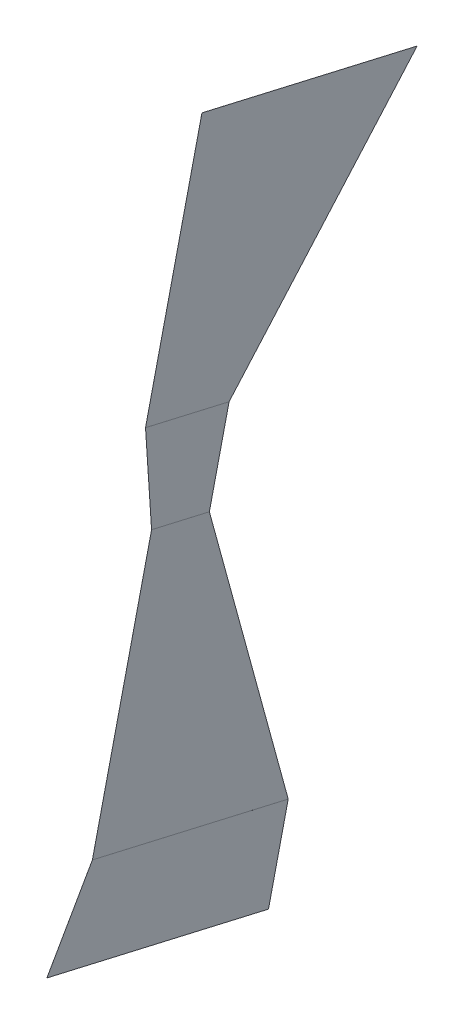
ISO-10303-21;
HEADER;
FILE_DESCRIPTION(('STEP AP214'),'2;1');
FILE_NAME('part.step','',(''),(''),'','','');
FILE_SCHEMA(('AUTOMOTIVE_DESIGN { 1 0 10303 214 1 1 1 1 }'));
ENDSEC;
DATA;
#1=APPLICATION_CONTEXT('core data for automotive mechanical design processes');
#2=APPLICATION_PROTOCOL_DEFINITION('international standard','automotive_design',2000,#1);
#3=PRODUCT_CONTEXT('',#1,'mechanical');
#4=PRODUCT('Part','Part','',(#3));
#5=PRODUCT_RELATED_PRODUCT_CATEGORY('part','',(#4));
#6=PRODUCT_DEFINITION_FORMATION('','',#4);
#7=PRODUCT_DEFINITION_CONTEXT('part definition',#1,'design');
#8=PRODUCT_DEFINITION('design','',#6,#7);
#9=PRODUCT_DEFINITION_SHAPE('','',#8);
#10=(LENGTH_UNIT() NAMED_UNIT(*) SI_UNIT(.MILLI.,.METRE.));
#11=(NAMED_UNIT(*) PLANE_ANGLE_UNIT() SI_UNIT($,.RADIAN.));
#12=(NAMED_UNIT(*) SI_UNIT($,.STERADIAN.) SOLID_ANGLE_UNIT());
#13=UNCERTAINTY_MEASURE_WITH_UNIT(LENGTH_MEASURE(1.E-05),#10,'distance_accuracy_value','');
#14=(GEOMETRIC_REPRESENTATION_CONTEXT(3) GLOBAL_UNCERTAINTY_ASSIGNED_CONTEXT((#13)) GLOBAL_UNIT_ASSIGNED_CONTEXT((#10,
#11,#12)) REPRESENTATION_CONTEXT('',''));
#15=CARTESIAN_POINT('',(0.,0.,0.));
#16=DIRECTION('',(0.,0.,1.));
#17=DIRECTION('',(1.,0.,0.));
#18=AXIS2_PLACEMENT_3D('',#15,#16,#17);
#19=CARTESIAN_POINT('',(-289.91223421039,372.415812345592,-85.9789649427927));
#20=DIRECTION('',(5.44647031252664E-12,0.97437006478523,-0.224951054343887));
#21=DIRECTION('',(-0.97437006478523,-0.0506029768452555,-0.219185573395753));
#22=AXIS2_PLACEMENT_3D('',#19,#20,#21);
#23=PLANE('',#22);
#24=DIRECTION('',(-1.,0.,0.));
#25=VECTOR('',#24,1.);
#26=CARTESIAN_POINT('',(92.3000000000171,334.361669563077,-250.809566312546));
#27=LINE('',#26,#25);
#28=CARTESIAN_POINT('',(92.301000000017,334.361669563077,-250.809566312546));
#29=VERTEX_POINT('',#28);
#30=CARTESIAN_POINT('',(92.3005000000171,334.361669563078,-250.809566312546));
#31=VERTEX_POINT('',#30);
#32=EDGE_CURVE('E11',#29,#31,#27,.T.);
#33=ORIENTED_EDGE('',*,*,#32,.T.);
#34=DIRECTION('',(0.,0.224951054343885,0.97437006478523));
#35=VECTOR('',#34,1.);
#36=CARTESIAN_POINT('',(92.3005000000171,334.361669563078,-250.809566312546));
#37=LINE('',#36,#35);
#38=CARTESIAN_POINT('',(92.3005000000171,339.949624513103,-226.605474259928));
#39=VERTEX_POINT('',#38);
#40=EDGE_CURVE('E305',#31,#39,#37,.T.);
#41=ORIENTED_EDGE('',*,*,#40,.T.);
#42=DIRECTION('',(-1.,5.28524446430367E-12,-1.31888944210345E-12));
#43=VECTOR('',#42,1.);
#44=CARTESIAN_POINT('',(92.300000000017,339.949624513103,-226.605474259928));
#45=LINE('',#44,#43);
#46=CARTESIAN_POINT('',(92.301000000017,339.949624513103,-226.605474259928));
#47=VERTEX_POINT('',#46);
#48=EDGE_CURVE('E566',#47,#39,#45,.T.);
#49=ORIENTED_EDGE('',*,*,#48,.F.);
#50=DIRECTION('',(0.,-0.224951054343887,-0.97437006478523));
#51=VECTOR('',#50,1.);
#52=CARTESIAN_POINT('',(92.3010000000171,327.544278520278,-280.338931139992));
#53=LINE('',#52,#51);
#54=EDGE_CURVE('E56',#47,#29,#53,.T.);
#55=ORIENTED_EDGE('',*,*,#54,.T.);
#56=EDGE_LOOP('',(#33,#41,#49,#55));
#57=FACE_BOUND('',#56,.T.);
#58=ADVANCED_FACE('F47',(#57),#23,.T.);
#59=CARTESIAN_POINT('',(210.000000001972,347.668414373481,-80.2655779379064));
#60=DIRECTION('',(-5.07068916209516E-12,0.974370064785231,-0.224951054343887));
#61=DIRECTION('',(0.,-0.224951054343887,-0.97437006478523));
#62=AXIS2_PLACEMENT_3D('',#59,#60,#61);
#63=PLANE('',#62);
#64=DIRECTION('',(-1.,0.,0.));
#65=VECTOR('',#64,1.);
#66=CARTESIAN_POINT('',(92.300000000017,309.61402935441,-245.097228556061));
#67=LINE('',#66,#65);
#68=CARTESIAN_POINT('',(92.3010000000171,309.61402935441,-245.097228556061));
#69=VERTEX_POINT('',#68);
#70=CARTESIAN_POINT('',(92.300500000017,309.61402935441,-245.097228556061));
#71=VERTEX_POINT('',#70);
#72=EDGE_CURVE('E558',#69,#71,#67,.T.);
#73=ORIENTED_EDGE('',*,*,#72,.T.);
#74=DIRECTION('',(0.,-0.224951054343887,-0.97437006478523));
#75=VECTOR('',#74,1.);
#76=CARTESIAN_POINT('',(92.300500000017,311.54631263088,-236.727590161748));
#77=LINE('',#76,#75);
#78=CARTESIAN_POINT('',(92.300500000017,313.478217909947,-228.359589054072));
#79=VERTEX_POINT('',#78);
#80=EDGE_CURVE('E386',#71,#79,#77,.F.);
#81=ORIENTED_EDGE('',*,*,#80,.T.);
#82=DIRECTION('',(-1.,-4.6774042972153E-12,2.28120300427292E-12));
#83=VECTOR('',#82,1.);
#84=CARTESIAN_POINT('',(92.3000000000171,313.478217909947,-228.359589054072));
#85=LINE('',#84,#83);
#86=CARTESIAN_POINT('',(92.3010000000171,313.478217909947,-228.359589054072));
#87=VERTEX_POINT('',#86);
#88=EDGE_CURVE('E551',#87,#79,#85,.T.);
#89=ORIENTED_EDGE('',*,*,#88,.F.);
#90=DIRECTION('',(0.,-0.224951054343887,-0.97437006478523));
#91=VECTOR('',#90,1.);
#92=CARTESIAN_POINT('',(92.3010000000171,302.796880549614,-274.625544135439));
#93=LINE('',#92,#91);
#94=EDGE_CURVE('E555',#87,#69,#93,.T.);
#95=ORIENTED_EDGE('',*,*,#94,.T.);
#96=EDGE_LOOP('',(#73,#81,#89,#95));
#97=FACE_BOUND('',#96,.T.);
#98=ADVANCED_FACE('F825',(#97),#63,.T.);
#99=CARTESIAN_POINT('',(210.000000004564,273.425312917657,-63.1252074012469));
#100=DIRECTION('',(9.88168401182418E-12,-0.974370064785231,0.224951054343887));
#101=DIRECTION('',(0.,0.224951054343887,0.97437006478523));
#102=AXIS2_PLACEMENT_3D('',#99,#100,#101);
#103=PLANE('',#102);
#104=DIRECTION('',(-1.,0.,0.));
#105=VECTOR('',#104,1.);
#106=CARTESIAN_POINT('',(92.3000000000171,239.235116453571,-211.219218517285));
#107=LINE('',#106,#105);
#108=CARTESIAN_POINT('',(92.3010000000171,239.235116453571,-211.219218517285));
#109=VERTEX_POINT('',#108);
#110=CARTESIAN_POINT('',(92.300500000017,239.235116453571,-211.219218517285));
#111=VERTEX_POINT('',#110);
#112=EDGE_CURVE('E543',#109,#111,#107,.T.);
#113=ORIENTED_EDGE('',*,*,#112,.T.);
#114=DIRECTION('',(0.,-0.224951054343889,-0.97437006478523));
#115=VECTOR('',#114,1.);
#116=CARTESIAN_POINT('',(92.300500000017,239.235116453571,-211.219218517285));
#117=LINE('',#116,#115);
#118=CARTESIAN_POINT('',(92.3005000000171,226.142144451095,-267.931110868683));
#119=VERTEX_POINT('',#118);
#120=EDGE_CURVE('E424',#111,#119,#117,.T.);
#121=ORIENTED_EDGE('',*,*,#120,.T.);
#122=DIRECTION('',(-1.,-9.71598496102288E-12,1.84363635469253E-12));
#123=VECTOR('',#122,1.);
#124=CARTESIAN_POINT('',(92.3000000000171,226.142144451095,-267.931110868683));
#125=LINE('',#124,#123);
#126=CARTESIAN_POINT('',(92.3010000000171,226.142144451095,-267.931110868683));
#127=VERTEX_POINT('',#126);
#128=EDGE_CURVE('E536',#127,#119,#125,.T.);
#129=ORIENTED_EDGE('',*,*,#128,.F.);
#130=DIRECTION('',(0.,0.224951054343887,0.97437006478523));
#131=VECTOR('',#130,1.);
#132=CARTESIAN_POINT('',(92.3010000000171,228.553779093238,-257.485173598653));
#133=LINE('',#132,#131);
#134=EDGE_CURVE('E540',#127,#109,#133,.T.);
#135=ORIENTED_EDGE('',*,*,#134,.T.);
#136=EDGE_LOOP('',(#113,#121,#129,#135));
#137=FACE_BOUND('',#136,.T.);
#138=ADVANCED_FACE('F830',(#137),#103,.T.);
#139=CARTESIAN_POINT('',(92.3000000000171,239.233167713442,-211.218768615177));
#140=DIRECTION('',(0.,0.224951054343891,0.97437006478523));
#141=DIRECTION('',(0.,-0.97437006478523,0.224951054343891));
#142=AXIS2_PLACEMENT_3D('',#139,#140,#141);
#143=PLANE('',#142);
#144=ORIENTED_EDGE('',*,*,#112,.F.);
#145=DIRECTION('',(0.,-0.97437006478523,0.224951054343891));
#146=VECTOR('',#145,1.);
#147=CARTESIAN_POINT('',(92.3010000000171,239.233167713442,-211.218768615177));
#148=LINE('',#147,#146);
#149=EDGE_CURVE('E512',#87,#109,#148,.T.);
#150=ORIENTED_EDGE('',*,*,#149,.F.);
#151=ORIENTED_EDGE('',*,*,#88,.T.);
#152=DIRECTION('',(-1.,0.,0.));
#153=VECTOR('',#152,1.);
#154=CARTESIAN_POINT('',(92.300000000017,313.478217909946,-228.359589054072));
#155=LINE('',#154,#153);
#156=CARTESIAN_POINT('',(92.3000000000171,313.478217909947,-228.359589054072));
#157=VERTEX_POINT('',#156);
#158=EDGE_CURVE('E416',#79,#157,#155,.T.);
#159=ORIENTED_EDGE('',*,*,#158,.T.);
#160=DIRECTION('',(0.,-0.97437006478523,0.224951054343891));
#161=VECTOR('',#160,1.);
#162=CARTESIAN_POINT('',(92.3000000000171,239.233167713442,-211.218768615177));
#163=LINE('',#162,#161);
#164=CARTESIAN_POINT('',(92.300000000017,239.235116453571,-211.219218517285));
#165=VERTEX_POINT('',#164);
#166=EDGE_CURVE('E517',#157,#165,#163,.T.);
#167=ORIENTED_EDGE('',*,*,#166,.T.);
#168=DIRECTION('',(-1.,0.,0.));
#169=VECTOR('',#168,1.);
#170=CARTESIAN_POINT('',(92.300000000017,239.235116453571,-211.219218517285));
#171=LINE('',#170,#169);
#172=EDGE_CURVE('E508',#111,#165,#171,.T.);
#173=ORIENTED_EDGE('',*,*,#172,.F.);
#174=EDGE_LOOP('',(#144,#150,#151,#159,#167,#173));
#175=FACE_BOUND('',#174,.T.);
#176=ADVANCED_FACE('F836',(#175),#143,.T.);
#177=CARTESIAN_POINT('',(92.3000000000171,231.042743473739,-266.590543305437));
#178=DIRECTION('',(0.,-0.263857553924067,0.964561657561199));
#179=DIRECTION('',(0.,-0.9645616575612,-0.263857553924067));
#180=AXIS2_PLACEMENT_3D('',#177,#178,#179);
#181=PLANE('',#180);
#182=ORIENTED_EDGE('',*,*,#72,.F.);
#183=DIRECTION('',(0.,-0.9645616575612,-0.263857553924067));
#184=VECTOR('',#183,1.);
#185=CARTESIAN_POINT('',(92.3010000000171,231.042743473739,-266.590543305437));
#186=LINE('',#185,#184);
#187=EDGE_CURVE('E522',#69,#127,#186,.T.);
#188=ORIENTED_EDGE('',*,*,#187,.T.);
#189=ORIENTED_EDGE('',*,*,#128,.T.);
#190=DIRECTION('',(-1.,0.,0.));
#191=VECTOR('',#190,1.);
#192=CARTESIAN_POINT('',(92.3000000000171,226.142144451095,-267.931110868683));
#193=LINE('',#192,#191);
#194=CARTESIAN_POINT('',(92.3000000000171,226.142144451095,-267.931110868683));
#195=VERTEX_POINT('',#194);
#196=EDGE_CURVE('E503',#119,#195,#193,.T.);
#197=ORIENTED_EDGE('',*,*,#196,.T.);
#198=DIRECTION('',(0.,-0.9645616575612,-0.263857553924067));
#199=VECTOR('',#198,1.);
#200=CARTESIAN_POINT('',(92.3000000000171,231.042743473739,-266.590543305437));
#201=LINE('',#200,#199);
#202=CARTESIAN_POINT('',(92.300000000017,309.61402935441,-245.097228556061));
#203=VERTEX_POINT('',#202);
#204=EDGE_CURVE('E521',#203,#195,#201,.T.);
#205=ORIENTED_EDGE('',*,*,#204,.F.);
#206=DIRECTION('',(-1.,0.,0.));
#207=VECTOR('',#206,1.);
#208=CARTESIAN_POINT('',(92.300000000017,309.61402935441,-245.097228556061));
#209=LINE('',#208,#207);
#210=EDGE_CURVE('E400',#71,#203,#209,.T.);
#211=ORIENTED_EDGE('',*,*,#210,.F.);
#212=EDGE_LOOP('',(#182,#188,#189,#197,#205,#211));
#213=FACE_BOUND('',#212,.T.);
#214=ADVANCED_FACE('F840',(#213),#181,.F.);
#215=CARTESIAN_POINT('',(92.3000000000171,228.551830353109,-257.484723696544));
#216=DIRECTION('',(1.,0.,0.));
#217=DIRECTION('',(0.,0.898794046299148,-0.438371146789118));
#218=AXIS2_PLACEMENT_3D('',#215,#216,#217);
#219=PLANE('',#218);
#220=ORIENTED_EDGE('',*,*,#166,.F.);
#221=DIRECTION('',(0.,-0.224951054343887,-0.97437006478523));
#222=VECTOR('',#221,1.);
#223=CARTESIAN_POINT('',(92.3000000000171,302.796880549614,-274.625544135439));
#224=LINE('',#223,#222);
#225=EDGE_CURVE('E547',#157,#203,#224,.T.);
#226=ORIENTED_EDGE('',*,*,#225,.T.);
#227=ORIENTED_EDGE('',*,*,#204,.T.);
#228=DIRECTION('',(0.,0.224951054343887,0.97437006478523));
#229=VECTOR('',#228,1.);
#230=CARTESIAN_POINT('',(92.3000000000171,228.553779093238,-257.485173598653));
#231=LINE('',#230,#229);
#232=EDGE_CURVE('E526',#195,#165,#231,.T.);
#233=ORIENTED_EDGE('',*,*,#232,.T.);
#234=EDGE_LOOP('',(#220,#226,#227,#233));
#235=FACE_BOUND('',#234,.T.);
#236=ADVANCED_FACE('F844',(#235),#219,.F.);
#237=CARTESIAN_POINT('',(92.3010000000171,228.551830353109,-257.484723696544));
#238=DIRECTION('',(1.,0.,0.));
#239=DIRECTION('',(0.,0.898794046299148,-0.438371146789118));
#240=AXIS2_PLACEMENT_3D('',#237,#238,#239);
#241=PLANE('',#240);
#242=ORIENTED_EDGE('',*,*,#149,.T.);
#243=ORIENTED_EDGE('',*,*,#134,.F.);
#244=ORIENTED_EDGE('',*,*,#187,.F.);
#245=ORIENTED_EDGE('',*,*,#94,.F.);
#246=EDGE_LOOP('',(#242,#243,#244,#245));
#247=FACE_BOUND('',#246,.T.);
#248=ADVANCED_FACE('F846',(#247),#241,.T.);
#249=CARTESIAN_POINT('',(92.300000000017,239.235116453571,-211.219218517285));
#250=DIRECTION('',(0.,0.97437006478523,-0.224951054343889));
#251=DIRECTION('',(0.,-0.224951054343889,-0.97437006478523));
#252=AXIS2_PLACEMENT_3D('',#249,#250,#251);
#253=PLANE('',#252);
#254=ORIENTED_EDGE('',*,*,#232,.F.);
#255=CARTESIAN_POINT('',(92.2995000000171,226.142144451095,-267.931110868683));
#256=VERTEX_POINT('',#255);
#257=EDGE_CURVE('E501',#195,#256,#193,.T.);
#258=ORIENTED_EDGE('',*,*,#257,.T.);
#259=DIRECTION('',(0.,-0.224951054343889,-0.97437006478523));
#260=VECTOR('',#259,1.);
#261=CARTESIAN_POINT('',(92.2995000000171,239.235116453571,-211.219218517285));
#262=LINE('',#261,#260);
#263=CARTESIAN_POINT('',(92.2995000000171,239.235116453571,-211.219218517285));
#264=VERTEX_POINT('',#263);
#265=EDGE_CURVE('E474',#264,#256,#262,.T.);
#266=ORIENTED_EDGE('',*,*,#265,.F.);
#267=EDGE_CURVE('E507',#165,#264,#171,.T.);
#268=ORIENTED_EDGE('',*,*,#267,.F.);
#269=EDGE_LOOP('',(#254,#258,#266,#268));
#270=FACE_BOUND('',#269,.T.);
#271=ADVANCED_FACE('F849',(#270),#253,.T.);
#272=CARTESIAN_POINT('',(92.3000000000171,226.142144451095,-267.931110868683));
#273=DIRECTION('',(0.,0.20042379996439,-0.979709293825385));
#274=DIRECTION('',(0.,-0.979709293825385,-0.20042379996439));
#275=AXIS2_PLACEMENT_3D('',#272,#273,#274);
#276=PLANE('',#275);
#277=ORIENTED_EDGE('',*,*,#196,.F.);
#278=DIRECTION('',(0.,-0.979709293825385,-0.20042379996439));
#279=VECTOR('',#278,1.);
#280=CARTESIAN_POINT('',(92.3005000000171,226.142144451095,-267.931110868683));
#281=LINE('',#280,#279);
#282=CARTESIAN_POINT('',(92.300500000017,226.139606407714,-267.931630088315));
#283=VERTEX_POINT('',#282);
#284=EDGE_CURVE('E487',#119,#283,#281,.T.);
#285=ORIENTED_EDGE('',*,*,#284,.T.);
#286=DIRECTION('',(-1.,0.,0.));
#287=VECTOR('',#286,1.);
#288=CARTESIAN_POINT('',(92.3000000000171,226.139606407714,-267.931630088315));
#289=LINE('',#288,#287);
#290=CARTESIAN_POINT('',(92.3000000000171,226.139606407714,-267.931630088315));
#291=VERTEX_POINT('',#290);
#292=EDGE_CURVE('E497',#283,#291,#289,.T.);
#293=ORIENTED_EDGE('',*,*,#292,.T.);
#294=CARTESIAN_POINT('',(92.2995000000171,226.139606407714,-267.931630088315));
#295=VERTEX_POINT('',#294);
#296=EDGE_CURVE('E502',#291,#295,#289,.T.);
#297=ORIENTED_EDGE('',*,*,#296,.T.);
#298=DIRECTION('',(0.,-0.979709293825385,-0.20042379996439));
#299=VECTOR('',#298,1.);
#300=CARTESIAN_POINT('',(92.2995000000171,226.142144451095,-267.931110868683));
#301=LINE('',#300,#299);
#302=EDGE_CURVE('E470',#256,#295,#301,.T.);
#303=ORIENTED_EDGE('',*,*,#302,.F.);
#304=ORIENTED_EDGE('',*,*,#257,.F.);
#305=EDGE_LOOP('',(#277,#285,#293,#297,#303,#304));
#306=FACE_BOUND('',#305,.T.);
#307=ADVANCED_FACE('F862',(#306),#276,.T.);
#308=CARTESIAN_POINT('',(92.3000000000171,226.139606407714,-267.931630088315));
#309=DIRECTION('',(0.,-0.974370064785231,0.224951054343887));
#310=DIRECTION('',(0.,0.224951054343887,0.97437006478523));
#311=AXIS2_PLACEMENT_3D('',#308,#309,#310);
#312=PLANE('',#311);
#313=DIRECTION('',(0.,-0.224951054343887,-0.97437006478523));
#314=VECTOR('',#313,1.);
#315=CARTESIAN_POINT('',(92.300000000017,228.55148328786,-257.484643570218));
#316=LINE('',#315,#314);
#317=CARTESIAN_POINT('',(92.300000000017,239.232956407594,-211.218100450281));
#318=VERTEX_POINT('',#317);
#319=EDGE_CURVE('E448',#318,#291,#316,.T.);
#320=ORIENTED_EDGE('',*,*,#319,.F.);
#321=DIRECTION('',(-1.,0.,0.));
#322=VECTOR('',#321,1.);
#323=CARTESIAN_POINT('',(92.300000000017,239.232956407594,-211.218100450281));
#324=LINE('',#323,#322);
#325=CARTESIAN_POINT('',(92.2995000000171,239.232956407594,-211.218100450281));
#326=VERTEX_POINT('',#325);
#327=EDGE_CURVE('E482',#318,#326,#324,.T.);
#328=ORIENTED_EDGE('',*,*,#327,.T.);
#329=DIRECTION('',(0.,0.224951054343887,0.97437006478523));
#330=VECTOR('',#329,1.);
#331=CARTESIAN_POINT('',(92.2995000000171,226.139606407714,-267.931630088315));
#332=LINE('',#331,#330);
#333=EDGE_CURVE('E465',#295,#326,#332,.T.);
#334=ORIENTED_EDGE('',*,*,#333,.F.);
#335=ORIENTED_EDGE('',*,*,#296,.F.);
#336=EDGE_LOOP('',(#320,#328,#334,#335));
#337=FACE_BOUND('',#336,.T.);
#338=ADVANCED_FACE('F858',(#337),#312,.T.);
#339=CARTESIAN_POINT('',(92.300000000017,239.232956407594,-211.218100450281));
#340=DIRECTION('',(0.,0.459682986595463,0.888083077101842));
#341=DIRECTION('',(0.,0.888083077101842,-0.459682986595463));
#342=AXIS2_PLACEMENT_3D('',#339,#340,#341);
#343=PLANE('',#342);
#344=DIRECTION('',(0.,0.888083077101842,-0.459682986595463));
#345=VECTOR('',#344,1.);
#346=CARTESIAN_POINT('',(92.300500000017,239.232956407594,-211.218100450281));
#347=LINE('',#346,#345);
#348=CARTESIAN_POINT('',(92.300500000017,239.232956407594,-211.218100450281));
#349=VERTEX_POINT('',#348);
#350=EDGE_CURVE('E478',#349,#111,#347,.T.);
#351=ORIENTED_EDGE('',*,*,#350,.T.);
#352=ORIENTED_EDGE('',*,*,#172,.T.);
#353=ORIENTED_EDGE('',*,*,#267,.T.);
#354=DIRECTION('',(0.,0.888083077101842,-0.459682986595463));
#355=VECTOR('',#354,1.);
#356=CARTESIAN_POINT('',(92.2995000000171,239.232956407594,-211.218100450281));
#357=LINE('',#356,#355);
#358=EDGE_CURVE('E469',#326,#264,#357,.T.);
#359=ORIENTED_EDGE('',*,*,#358,.F.);
#360=ORIENTED_EDGE('',*,*,#327,.F.);
#361=EDGE_CURVE('E513',#349,#318,#324,.T.);
#362=ORIENTED_EDGE('',*,*,#361,.F.);
#363=EDGE_LOOP('',(#351,#352,#353,#359,#360,#362));
#364=FACE_BOUND('',#363,.T.);
#365=ADVANCED_FACE('F854',(#364),#343,.T.);
#366=CARTESIAN_POINT('',(92.2995000000171,232.687482549644,-239.574899678767));
#367=DIRECTION('',(-1.,0.,0.));
#368=DIRECTION('',(0.,-0.898794046299148,0.438371146789118));
#369=AXIS2_PLACEMENT_3D('',#366,#367,#368);
#370=PLANE('',#369);
#371=ORIENTED_EDGE('',*,*,#333,.T.);
#372=ORIENTED_EDGE('',*,*,#358,.T.);
#373=ORIENTED_EDGE('',*,*,#265,.T.);
#374=ORIENTED_EDGE('',*,*,#302,.T.);
#375=EDGE_LOOP('',(#371,#372,#373,#374));
#376=FACE_BOUND('',#375,.T.);
#377=ADVANCED_FACE('F857',(#376),#370,.T.);
#378=CARTESIAN_POINT('',(92.3005000000171,232.687482549644,-239.574899678767));
#379=DIRECTION('',(-1.,0.,0.));
#380=DIRECTION('',(0.,-0.898794046299148,0.438371146789118));
#381=AXIS2_PLACEMENT_3D('',#378,#379,#380);
#382=PLANE('',#381);
#383=DIRECTION('',(0.,0.224951054343887,0.97437006478523));
#384=VECTOR('',#383,1.);
#385=CARTESIAN_POINT('',(92.300500000017,226.139606407714,-267.931630088315));
#386=LINE('',#385,#384);
#387=EDGE_CURVE('E483',#283,#349,#386,.T.);
#388=ORIENTED_EDGE('',*,*,#387,.F.);
#389=ORIENTED_EDGE('',*,*,#284,.F.);
#390=ORIENTED_EDGE('',*,*,#120,.F.);
#391=ORIENTED_EDGE('',*,*,#350,.F.);
#392=EDGE_LOOP('',(#388,#389,#390,#391));
#393=FACE_BOUND('',#392,.T.);
#394=ADVANCED_FACE('F870',(#393),#382,.F.);
#395=CARTESIAN_POINT('',(550.712234210072,273.423017110572,-63.1246773724179));
#396=DIRECTION('',(1.28501611747959E-12,0.974370064785231,-0.224951054343887));
#397=DIRECTION('',(-0.974370064785231,0.0506029768516463,0.219185573394277));
#398=AXIS2_PLACEMENT_3D('',#395,#396,#397);
#399=PLANE('',#398);
#400=DIRECTION('',(-1.,0.,0.));
#401=VECTOR('',#400,1.);
#402=CARTESIAN_POINT('',(92.3000000000171,226.139606407714,-267.931630088315));
#403=LINE('',#402,#401);
#404=CARTESIAN_POINT('',(92.3010000000171,226.139606407714,-267.931630088315));
#405=VERTEX_POINT('',#404);
#406=EDGE_CURVE('E459',#405,#283,#403,.T.);
#407=ORIENTED_EDGE('',*,*,#406,.T.);
#408=ORIENTED_EDGE('',*,*,#387,.T.);
#409=DIRECTION('',(-1.,2.15149426052719E-12,3.60672602894851E-12));
#410=VECTOR('',#409,1.);
#411=CARTESIAN_POINT('',(92.300000000017,239.232956407594,-211.218100450281));
#412=LINE('',#411,#410);
#413=CARTESIAN_POINT('',(92.301000000017,239.232956407594,-211.218100450281));
#414=VERTEX_POINT('',#413);
#415=EDGE_CURVE('E425',#414,#349,#412,.T.);
#416=ORIENTED_EDGE('',*,*,#415,.F.);
#417=DIRECTION('',(0.,-0.224951054343887,-0.97437006478523));
#418=VECTOR('',#417,1.);
#419=CARTESIAN_POINT('',(92.3010000000171,228.55148328786,-257.484643570218));
#420=LINE('',#419,#418);
#421=EDGE_CURVE('E415',#414,#405,#420,.T.);
#422=ORIENTED_EDGE('',*,*,#421,.T.);
#423=EDGE_LOOP('',(#407,#408,#416,#422));
#424=FACE_BOUND('',#423,.T.);
#425=ADVANCED_FACE('F873',(#424),#399,.T.);
#426=CARTESIAN_POINT('',(92.300000000017,203.804432382445,-251.771336691992));
#427=DIRECTION('',(0.,0.974370064785231,-0.224951054343887));
#428=DIRECTION('',(0.,0.224951054343887,0.97437006478523));
#429=AXIS2_PLACEMENT_3D('',#426,#427,#428);
#430=PLANE('',#429);
#431=DIRECTION('',(-1.,0.,0.));
#432=VECTOR('',#431,1.);
#433=CARTESIAN_POINT('',(92.300000000017,201.392555502298,-262.218323210089));
#434=LINE('',#433,#432);
#435=CARTESIAN_POINT('',(92.3010000000171,201.392555502298,-262.218323210089));
#436=VERTEX_POINT('',#435);
#437=CARTESIAN_POINT('',(92.300000000017,201.392555502298,-262.218323210089));
#438=VERTEX_POINT('',#437);
#439=EDGE_CURVE('E433',#436,#438,#434,.T.);
#440=ORIENTED_EDGE('',*,*,#439,.F.);
#441=DIRECTION('',(0.,-0.224951054343887,-0.97437006478523));
#442=VECTOR('',#441,1.);
#443=CARTESIAN_POINT('',(92.3010000000171,203.804432382445,-251.771336691992));
#444=LINE('',#443,#442);
#445=CARTESIAN_POINT('',(92.3010000000171,216.209914134671,-198.037291773358));
#446=VERTEX_POINT('',#445);
#447=EDGE_CURVE('E455',#436,#446,#444,.F.);
#448=ORIENTED_EDGE('',*,*,#447,.T.);
#449=DIRECTION('',(-1.,0.,0.));
#450=VECTOR('',#449,1.);
#451=CARTESIAN_POINT('',(92.3000000000171,216.209914134671,-198.037291773358));
#452=LINE('',#451,#450);
#453=CARTESIAN_POINT('',(92.3000000000171,216.209914134671,-198.037291773358));
#454=VERTEX_POINT('',#453);
#455=EDGE_CURVE('E452',#446,#454,#452,.T.);
#456=ORIENTED_EDGE('',*,*,#455,.T.);
#457=DIRECTION('',(0.,0.224951054343887,0.97437006478523));
#458=VECTOR('',#457,1.);
#459=CARTESIAN_POINT('',(92.300000000017,203.804432382445,-251.771336691992));
#460=LINE('',#459,#458);
#461=EDGE_CURVE('E440',#438,#454,#460,.T.);
#462=ORIENTED_EDGE('',*,*,#461,.F.);
#463=EDGE_LOOP('',(#440,#448,#456,#462));
#464=FACE_BOUND('',#463,.T.);
#465=ADVANCED_FACE('F880',(#464),#430,.F.);
#466=CARTESIAN_POINT('',(92.300000000017,203.804432382445,-251.771336691992));
#467=DIRECTION('',(1.,0.,0.));
#468=DIRECTION('',(0.,-0.224951054343887,-0.97437006478523));
#469=AXIS2_PLACEMENT_3D('',#466,#467,#468);
#470=PLANE('',#469);
#471=DIRECTION('',(0.,-0.867840415356348,0.496843047122653));
#472=VECTOR('',#471,1.);
#473=CARTESIAN_POINT('',(92.300000000017,230.03583402252,-205.952701156006));
#474=LINE('',#473,#472);
#475=EDGE_CURVE('E420',#318,#454,#474,.T.);
#476=ORIENTED_EDGE('',*,*,#475,.F.);
#477=ORIENTED_EDGE('',*,*,#319,.T.);
#478=DIRECTION('',(0.,-0.974370064785231,0.224951054343887));
#479=VECTOR('',#478,1.);
#480=CARTESIAN_POINT('',(92.300000000017,201.392555502298,-262.218323210089));
#481=LINE('',#480,#479);
#482=EDGE_CURVE('E444',#291,#438,#481,.T.);
#483=ORIENTED_EDGE('',*,*,#482,.T.);
#484=ORIENTED_EDGE('',*,*,#461,.T.);
#485=EDGE_LOOP('',(#476,#477,#483,#484));
#486=FACE_BOUND('',#485,.T.);
#487=ADVANCED_FACE('F894',(#486),#470,.F.);
#488=CARTESIAN_POINT('',(92.300000000017,201.392555502298,-262.218323210089));
#489=DIRECTION('',(0.,0.224951054343887,0.97437006478523));
#490=DIRECTION('',(0.,-0.974370064785231,0.224951054343887));
#491=AXIS2_PLACEMENT_3D('',#488,#489,#490);
#492=PLANE('',#491);
#493=ORIENTED_EDGE('',*,*,#406,.F.);
#494=DIRECTION('',(0.,0.974370064785231,-0.224951054343887));
#495=VECTOR('',#494,1.);
#496=CARTESIAN_POINT('',(92.3010000000171,201.392555502298,-262.218323210089));
#497=LINE('',#496,#495);
#498=EDGE_CURVE('E436',#405,#436,#497,.F.);
#499=ORIENTED_EDGE('',*,*,#498,.T.);
#500=ORIENTED_EDGE('',*,*,#439,.T.);
#501=ORIENTED_EDGE('',*,*,#482,.F.);
#502=ORIENTED_EDGE('',*,*,#292,.F.);
#503=EDGE_LOOP('',(#493,#499,#500,#501,#502));
#504=FACE_BOUND('',#503,.T.);
#505=ADVANCED_FACE('F890',(#504),#492,.F.);
#506=CARTESIAN_POINT('',(92.3010000000171,203.804432382445,-251.771336691992));
#507=DIRECTION('',(1.,0.,0.));
#508=DIRECTION('',(0.,-0.224951054343887,-0.97437006478523));
#509=AXIS2_PLACEMENT_3D('',#506,#507,#508);
#510=PLANE('',#509);
#511=DIRECTION('',(0.,-0.867840415356348,0.496843047122653));
#512=VECTOR('',#511,1.);
#513=CARTESIAN_POINT('',(92.301000000017,230.03583402252,-205.952701156006));
#514=LINE('',#513,#512);
#515=EDGE_CURVE('E429',#414,#446,#514,.T.);
#516=ORIENTED_EDGE('',*,*,#515,.T.);
#517=ORIENTED_EDGE('',*,*,#447,.F.);
#518=ORIENTED_EDGE('',*,*,#498,.F.);
#519=ORIENTED_EDGE('',*,*,#421,.F.);
#520=EDGE_LOOP('',(#516,#517,#518,#519));
#521=FACE_BOUND('',#520,.T.);
#522=ADVANCED_FACE('F886',(#521),#510,.T.);
#523=CARTESIAN_POINT('',(92.300000000017,230.03583402252,-205.952701156006));
#524=DIRECTION('',(0.,0.496843047122653,0.867840415356347));
#525=DIRECTION('',(0.,-0.867840415356348,0.496843047122653));
#526=AXIS2_PLACEMENT_3D('',#523,#524,#525);
#527=PLANE('',#526);
#528=ORIENTED_EDGE('',*,*,#455,.F.);
#529=ORIENTED_EDGE('',*,*,#515,.F.);
#530=ORIENTED_EDGE('',*,*,#415,.T.);
#531=ORIENTED_EDGE('',*,*,#361,.T.);
#532=ORIENTED_EDGE('',*,*,#475,.T.);
#533=EDGE_LOOP('',(#528,#529,#530,#531,#532));
#534=FACE_BOUND('',#533,.T.);
#535=ADVANCED_FACE('F882',(#534),#527,.T.);
#536=CARTESIAN_POINT('',(92.300000000017,311.54631263088,-236.727590161748));
#537=DIRECTION('',(0.,0.97437006478523,-0.224951054343887));
#538=DIRECTION('',(0.,-0.224951054343887,-0.97437006478523));
#539=AXIS2_PLACEMENT_3D('',#536,#537,#538);
#540=PLANE('',#539);
#541=ORIENTED_EDGE('',*,*,#225,.F.);
#542=CARTESIAN_POINT('',(92.2995000000171,313.478217909946,-228.359589054072));
#543=VERTEX_POINT('',#542);
#544=EDGE_CURVE('E385',#157,#543,#155,.T.);
#545=ORIENTED_EDGE('',*,*,#544,.T.);
#546=DIRECTION('',(0.,-0.224951054343887,-0.97437006478523));
#547=VECTOR('',#546,1.);
#548=CARTESIAN_POINT('',(92.299500000017,311.54631263088,-236.727590161748));
#549=LINE('',#548,#547);
#550=CARTESIAN_POINT('',(92.299500000017,309.61402935441,-245.097228556061));
#551=VERTEX_POINT('',#550);
#552=EDGE_CURVE('E368',#551,#543,#549,.F.);
#553=ORIENTED_EDGE('',*,*,#552,.F.);
#554=EDGE_CURVE('E405',#203,#551,#209,.T.);
#555=ORIENTED_EDGE('',*,*,#554,.F.);
#556=EDGE_LOOP('',(#541,#545,#553,#555));
#557=FACE_BOUND('',#556,.T.);
#558=ADVANCED_FACE('F885',(#557),#540,.F.);
#559=CARTESIAN_POINT('',(92.300000000017,311.548608436259,-236.728120190183));
#560=DIRECTION('',(0.,0.97437006478523,-0.224951054343887));
#561=DIRECTION('',(0.,-0.224951054343887,-0.97437006478523));
#562=AXIS2_PLACEMENT_3D('',#559,#560,#561);
#563=PLANE('',#562);
#564=DIRECTION('',(0.,0.224951054343887,0.97437006478523));
#565=VECTOR('',#564,1.);
#566=CARTESIAN_POINT('',(92.3000000000171,302.799176354992,-274.626074163874));
#567=LINE('',#566,#565);
#568=CARTESIAN_POINT('',(92.300000000017,309.616567397792,-245.096709336429));
#569=VERTEX_POINT('',#568);
#570=CARTESIAN_POINT('',(92.300000000017,313.480649474726,-228.359531043937));
#571=VERTEX_POINT('',#570);
#572=EDGE_CURVE('E354',#569,#571,#567,.T.);
#573=ORIENTED_EDGE('',*,*,#572,.F.);
#574=DIRECTION('',(-1.,0.,0.));
#575=VECTOR('',#574,1.);
#576=CARTESIAN_POINT('',(92.300000000017,309.616567397792,-245.096709336429));
#577=LINE('',#576,#575);
#578=CARTESIAN_POINT('',(92.299500000017,309.616567397792,-245.096709336429));
#579=VERTEX_POINT('',#578);
#580=EDGE_CURVE('E404',#569,#579,#577,.T.);
#581=ORIENTED_EDGE('',*,*,#580,.T.);
#582=DIRECTION('',(0.,-0.224951054343887,-0.97437006478523));
#583=VECTOR('',#582,1.);
#584=CARTESIAN_POINT('',(92.299500000017,311.548608436259,-236.728120190183));
#585=LINE('',#584,#583);
#586=CARTESIAN_POINT('',(92.2995000000169,313.480649474726,-228.359531043937));
#587=VERTEX_POINT('',#586);
#588=EDGE_CURVE('E377',#587,#579,#585,.T.);
#589=ORIENTED_EDGE('',*,*,#588,.F.);
#590=DIRECTION('',(-1.,0.,0.));
#591=VECTOR('',#590,1.);
#592=CARTESIAN_POINT('',(92.3000000000169,313.480649474726,-228.359531043937));
#593=LINE('',#592,#591);
#594=EDGE_CURVE('E410',#571,#587,#593,.T.);
#595=ORIENTED_EDGE('',*,*,#594,.F.);
#596=EDGE_LOOP('',(#573,#581,#589,#595));
#597=FACE_BOUND('',#596,.T.);
#598=ADVANCED_FACE('F908',(#597),#563,.T.);
#599=CARTESIAN_POINT('',(92.300000000017,309.616567397792,-245.096709336429));
#600=DIRECTION('',(0.,0.200423799969313,-0.979709293824378));
#601=DIRECTION('',(-9.70827584989564E-12,-0.979709293824378,-0.200423799969313));
#602=AXIS2_PLACEMENT_3D('',#599,#600,#601);
#603=PLANE('',#602);
#604=CARTESIAN_POINT('',(92.300500000017,309.616567397792,-245.096709336429));
#605=VERTEX_POINT('',#604);
#606=EDGE_CURVE('E406',#605,#569,#577,.T.);
#607=ORIENTED_EDGE('',*,*,#606,.F.);
#608=DIRECTION('',(-9.70827584989564E-12,-0.979709293824378,-0.200423799969313));
#609=VECTOR('',#608,1.);
#610=CARTESIAN_POINT('',(92.300500000017,309.616567397792,-245.096709336429));
#611=LINE('',#610,#609);
#612=EDGE_CURVE('E390',#605,#71,#611,.T.);
#613=ORIENTED_EDGE('',*,*,#612,.T.);
#614=ORIENTED_EDGE('',*,*,#210,.T.);
#615=ORIENTED_EDGE('',*,*,#554,.T.);
#616=DIRECTION('',(-9.70827584989564E-12,-0.979709293824378,-0.200423799969313));
#617=VECTOR('',#616,1.);
#618=CARTESIAN_POINT('',(92.299500000017,309.616567397792,-245.096709336429));
#619=LINE('',#618,#617);
#620=EDGE_CURVE('E373',#579,#551,#619,.T.);
#621=ORIENTED_EDGE('',*,*,#620,.F.);
#622=ORIENTED_EDGE('',*,*,#580,.F.);
#623=EDGE_LOOP('',(#607,#613,#614,#615,#621,#622));
#624=FACE_BOUND('',#623,.T.);
#625=ADVANCED_FACE('F906',(#624),#603,.T.);
#626=CARTESIAN_POINT('',(92.300000000017,313.478217909947,-228.359589054072));
#627=DIRECTION('',(0.,-0.0238503345300095,0.999715540312747));
#628=DIRECTION('',(-1.45604153733991E-11,0.999715540312747,0.0238503345300095));
#629=AXIS2_PLACEMENT_3D('',#626,#627,#628);
#630=PLANE('',#629);
#631=DIRECTION('',(-1.45604153733991E-11,0.999715540312747,0.0238503345300095));
#632=VECTOR('',#631,1.);
#633=CARTESIAN_POINT('',(92.300500000017,313.478217909947,-228.359589054072));
#634=LINE('',#633,#632);
#635=CARTESIAN_POINT('',(92.3005000000169,313.480649474726,-228.359531043937));
#636=VERTEX_POINT('',#635);
#637=EDGE_CURVE('E381',#79,#636,#634,.T.);
#638=ORIENTED_EDGE('',*,*,#637,.T.);
#639=EDGE_CURVE('E411',#636,#571,#593,.T.);
#640=ORIENTED_EDGE('',*,*,#639,.T.);
#641=ORIENTED_EDGE('',*,*,#594,.T.);
#642=DIRECTION('',(-1.45604153733991E-11,0.999715540312747,0.0238503345300095));
#643=VECTOR('',#642,1.);
#644=CARTESIAN_POINT('',(92.299500000017,313.478217909947,-228.359589054072));
#645=LINE('',#644,#643);
#646=EDGE_CURVE('E372',#543,#587,#645,.T.);
#647=ORIENTED_EDGE('',*,*,#646,.F.);
#648=ORIENTED_EDGE('',*,*,#544,.F.);
#649=ORIENTED_EDGE('',*,*,#158,.F.);
#650=EDGE_LOOP('',(#638,#640,#641,#647,#648,#649));
#651=FACE_BOUND('',#650,.T.);
#652=ADVANCED_FACE('F902',(#651),#630,.T.);
#653=CARTESIAN_POINT('',(92.299500000017,311.54746053357,-236.727855175966));
#654=DIRECTION('',(-1.,0.,0.));
#655=DIRECTION('',(0.,-0.224951054343887,-0.97437006478523));
#656=AXIS2_PLACEMENT_3D('',#653,#654,#655);
#657=PLANE('',#656);
#658=ORIENTED_EDGE('',*,*,#552,.T.);
#659=ORIENTED_EDGE('',*,*,#646,.T.);
#660=ORIENTED_EDGE('',*,*,#588,.T.);
#661=ORIENTED_EDGE('',*,*,#620,.T.);
#662=EDGE_LOOP('',(#658,#659,#660,#661));
#663=FACE_BOUND('',#662,.T.);
#664=ADVANCED_FACE('F905',(#663),#657,.T.);
#665=CARTESIAN_POINT('',(92.300500000017,311.54746053357,-236.727855175966));
#666=DIRECTION('',(-1.,0.,0.));
#667=DIRECTION('',(0.,-0.224951054343887,-0.97437006478523));
#668=AXIS2_PLACEMENT_3D('',#665,#666,#667);
#669=PLANE('',#668);
#670=ORIENTED_EDGE('',*,*,#80,.F.);
#671=ORIENTED_EDGE('',*,*,#612,.F.);
#672=DIRECTION('',(0.,-0.224951054343887,-0.97437006478523));
#673=VECTOR('',#672,1.);
#674=CARTESIAN_POINT('',(92.300500000017,311.548608436259,-236.728120190183));
#675=LINE('',#674,#673);
#676=EDGE_CURVE('E341',#636,#605,#675,.T.);
#677=ORIENTED_EDGE('',*,*,#676,.F.);
#678=ORIENTED_EDGE('',*,*,#637,.F.);
#679=EDGE_LOOP('',(#670,#671,#677,#678));
#680=FACE_BOUND('',#679,.T.);
#681=ADVANCED_FACE('F917',(#680),#669,.F.);
#682=CARTESIAN_POINT('',(-289.912234208974,347.670710175388,-80.26610796554));
#683=DIRECTION('',(7.75908685883931E-12,-0.97437006478523,0.224951054343887));
#684=DIRECTION('',(0.97437006478523,0.0506029768577928,0.219185573392858));
#685=AXIS2_PLACEMENT_3D('',#682,#683,#684);
#686=PLANE('',#685);
#687=DIRECTION('',(-1.,0.,0.));
#688=VECTOR('',#687,1.);
#689=CARTESIAN_POINT('',(92.300000000017,313.480649474726,-228.359531043937));
#690=LINE('',#689,#688);
#691=CARTESIAN_POINT('',(92.301000000017,313.480649474726,-228.359531043937));
#692=VERTEX_POINT('',#691);
#693=EDGE_CURVE('E362',#692,#636,#690,.T.);
#694=ORIENTED_EDGE('',*,*,#693,.T.);
#695=ORIENTED_EDGE('',*,*,#676,.T.);
#696=DIRECTION('',(-1.,-7.41392364167481E-12,2.37912467504486E-12));
#697=VECTOR('',#696,1.);
#698=CARTESIAN_POINT('',(92.300000000017,309.616567397792,-245.096709336429));
#699=LINE('',#698,#697);
#700=CARTESIAN_POINT('',(92.301000000017,309.616567397792,-245.096709336429));
#701=VERTEX_POINT('',#700);
#702=EDGE_CURVE('E337',#701,#605,#699,.T.);
#703=ORIENTED_EDGE('',*,*,#702,.F.);
#704=DIRECTION('',(0.,0.224951054343887,0.97437006478523));
#705=VECTOR('',#704,1.);
#706=CARTESIAN_POINT('',(92.3010000000171,302.799176354992,-274.626074163874));
#707=LINE('',#706,#705);
#708=EDGE_CURVE('E332',#701,#692,#707,.T.);
#709=ORIENTED_EDGE('',*,*,#708,.T.);
#710=EDGE_LOOP('',(#694,#695,#703,#709));
#711=FACE_BOUND('',#710,.T.);
#712=ADVANCED_FACE('F597',(#711),#686,.T.);
#713=CARTESIAN_POINT('',(92.3000000000171,327.546227260407,-280.3393810421));
#714=DIRECTION('',(1.,0.,0.));
#715=DIRECTION('',(0.,0.224951054343887,0.97437006478523));
#716=AXIS2_PLACEMENT_3D('',#713,#714,#715);
#717=PLANE('',#716);
#718=DIRECTION('',(0.,-0.997811454801421,-0.0661233745892609));
#719=VECTOR('',#718,1.);
#720=CARTESIAN_POINT('',(92.300000000017,324.055167444449,-227.658774593961));
#721=LINE('',#720,#719);
#722=CARTESIAN_POINT('',(92.300000000017,339.949624513103,-226.605474259928));
#723=VERTEX_POINT('',#722);
#724=EDGE_CURVE('E350',#723,#571,#721,.T.);
#725=ORIENTED_EDGE('',*,*,#724,.F.);
#726=DIRECTION('',(0.,-0.224951054343887,-0.97437006478523));
#727=VECTOR('',#726,1.);
#728=CARTESIAN_POINT('',(92.3000000000171,327.544278520278,-280.338931139992));
#729=LINE('',#728,#727);
#730=CARTESIAN_POINT('',(92.3000000000171,334.361669563078,-250.809566312546));
#731=VERTEX_POINT('',#730);
#732=EDGE_CURVE('E562',#723,#731,#729,.T.);
#733=ORIENTED_EDGE('',*,*,#732,.T.);
#734=DIRECTION('',(0.,-0.974370064785231,0.224951054343887));
#735=VECTOR('',#734,1.);
#736=CARTESIAN_POINT('',(92.3000000000171,334.363618303207,-250.810016214655));
#737=LINE('',#736,#735);
#738=EDGE_CURVE('E358',#731,#569,#737,.T.);
#739=ORIENTED_EDGE('',*,*,#738,.T.);
#740=ORIENTED_EDGE('',*,*,#572,.T.);
#741=EDGE_LOOP('',(#725,#733,#739,#740));
#742=FACE_BOUND('',#741,.T.);
#743=ADVANCED_FACE('F602',(#742),#717,.F.);
#744=CARTESIAN_POINT('',(92.300000000017,324.055167444449,-227.658774593961));
#745=DIRECTION('',(0.,-0.066123374589261,0.997811454801421));
#746=DIRECTION('',(0.,-0.997811454801421,-0.0661233745892609));
#747=AXIS2_PLACEMENT_3D('',#744,#745,#746);
#748=PLANE('',#747);
#749=ORIENTED_EDGE('',*,*,#693,.F.);
#750=DIRECTION('',(0.,-0.997811454801421,-0.0661233745892609));
#751=VECTOR('',#750,1.);
#752=CARTESIAN_POINT('',(92.3010000000171,324.055167444449,-227.658774593961));
#753=LINE('',#752,#751);
#754=EDGE_CURVE('E346',#47,#692,#753,.T.);
#755=ORIENTED_EDGE('',*,*,#754,.F.);
#756=ORIENTED_EDGE('',*,*,#48,.T.);
#757=DIRECTION('',(-1.,0.,0.));
#758=VECTOR('',#757,1.);
#759=CARTESIAN_POINT('',(92.3000000000171,339.949624513103,-226.605474259928));
#760=LINE('',#759,#758);
#761=EDGE_CURVE('E333',#39,#723,#760,.T.);
#762=ORIENTED_EDGE('',*,*,#761,.T.);
#763=ORIENTED_EDGE('',*,*,#724,.T.);
#764=ORIENTED_EDGE('',*,*,#639,.F.);
#765=EDGE_LOOP('',(#749,#755,#756,#762,#763,#764));
#766=FACE_BOUND('',#765,.T.);
#767=ADVANCED_FACE('F593',(#766),#748,.T.);
#768=CARTESIAN_POINT('',(92.3010000000171,327.546227260407,-280.3393810421));
#769=DIRECTION('',(1.,0.,0.));
#770=DIRECTION('',(0.,0.224951054343887,0.97437006478523));
#771=AXIS2_PLACEMENT_3D('',#768,#769,#770);
#772=PLANE('',#771);
#773=ORIENTED_EDGE('',*,*,#754,.T.);
#774=ORIENTED_EDGE('',*,*,#708,.F.);
#775=DIRECTION('',(0.,-0.97437006478523,0.224951054343887));
#776=VECTOR('',#775,1.);
#777=CARTESIAN_POINT('',(92.301000000017,334.363618303207,-250.810016214655));
#778=LINE('',#777,#776);
#779=EDGE_CURVE('E342',#29,#701,#778,.T.);
#780=ORIENTED_EDGE('',*,*,#779,.F.);
#781=ORIENTED_EDGE('',*,*,#54,.F.);
#782=EDGE_LOOP('',(#773,#774,#780,#781));
#783=FACE_BOUND('',#782,.T.);
#784=ADVANCED_FACE('F579',(#783),#772,.T.);
#785=CARTESIAN_POINT('',(92.3000000000171,334.363618303207,-250.810016214655));
#786=DIRECTION('',(0.,0.224951054343887,0.97437006478523));
#787=DIRECTION('',(0.,-0.974370064785231,0.224951054343887));
#788=AXIS2_PLACEMENT_3D('',#785,#786,#787);
#789=PLANE('',#788);
#790=ORIENTED_EDGE('',*,*,#32,.F.);
#791=ORIENTED_EDGE('',*,*,#779,.T.);
#792=ORIENTED_EDGE('',*,*,#702,.T.);
#793=ORIENTED_EDGE('',*,*,#606,.T.);
#794=ORIENTED_EDGE('',*,*,#738,.F.);
#795=DIRECTION('',(-1.,0.,0.));
#796=VECTOR('',#795,1.);
#797=CARTESIAN_POINT('',(92.3000000000171,334.361669563078,-250.809566312546));
#798=LINE('',#797,#796);
#799=EDGE_CURVE('E320',#31,#731,#798,.T.);
#800=ORIENTED_EDGE('',*,*,#799,.F.);
#801=EDGE_LOOP('',(#790,#791,#792,#793,#794,#800));
#802=FACE_BOUND('',#801,.T.);
#803=ADVANCED_FACE('F582',(#802),#789,.F.);
#804=CARTESIAN_POINT('',(92.3000000000171,334.361669563078,-250.809566312546));
#805=DIRECTION('',(0.,-0.974370064785231,0.224951054343885));
#806=DIRECTION('',(0.,0.224951054343885,0.97437006478523));
#807=AXIS2_PLACEMENT_3D('',#804,#805,#806);
#808=PLANE('',#807);
#809=ORIENTED_EDGE('',*,*,#732,.F.);
#810=CARTESIAN_POINT('',(92.2995000000171,339.949624513103,-226.605474259928));
#811=VERTEX_POINT('',#810);
#812=EDGE_CURVE('E304',#723,#811,#760,.T.);
#813=ORIENTED_EDGE('',*,*,#812,.T.);
#814=DIRECTION('',(0.,0.224951054343885,0.97437006478523));
#815=VECTOR('',#814,1.);
#816=CARTESIAN_POINT('',(92.2995000000171,334.361669563078,-250.809566312546));
#817=LINE('',#816,#815);
#818=CARTESIAN_POINT('',(92.2995000000171,334.361669563078,-250.809566312546));
#819=VERTEX_POINT('',#818);
#820=EDGE_CURVE('E287',#819,#811,#817,.T.);
#821=ORIENTED_EDGE('',*,*,#820,.F.);
#822=EDGE_CURVE('E325',#731,#819,#798,.T.);
#823=ORIENTED_EDGE('',*,*,#822,.F.);
#824=EDGE_LOOP('',(#809,#813,#821,#823));
#825=FACE_BOUND('',#824,.T.);
#826=ADVANCED_FACE('F605',(#825),#808,.T.);
#827=CARTESIAN_POINT('',(92.3000000000171,339.952056077882,-226.605416249793));
#828=DIRECTION('',(0.,0.974370064785229,-0.224951054343891));
#829=DIRECTION('',(0.,-0.224951054343891,-0.974370064785229));
#830=AXIS2_PLACEMENT_3D('',#827,#828,#829);
#831=PLANE('',#830);
#832=DIRECTION('',(0.,0.224951054343887,0.97437006478523));
#833=VECTOR('',#832,1.);
#834=CARTESIAN_POINT('',(92.3000000000171,327.546574325656,-280.339461168426));
#835=LINE('',#834,#833);
#836=CARTESIAN_POINT('',(92.3000000000171,334.363723130452,-250.811145589048));
#837=VERTEX_POINT('',#836);
#838=CARTESIAN_POINT('',(92.3000000000171,339.952056077882,-226.605416249793));
#839=VERTEX_POINT('',#838);
#840=EDGE_CURVE('E63',#837,#839,#835,.T.);
#841=ORIENTED_EDGE('',*,*,#840,.F.);
#842=DIRECTION('',(-1.,0.,0.));
#843=VECTOR('',#842,1.);
#844=CARTESIAN_POINT('',(92.3000000000171,334.363723130452,-250.811145589048));
#845=LINE('',#844,#843);
#846=CARTESIAN_POINT('',(92.2995000000171,334.363723130452,-250.811145589048));
#847=VERTEX_POINT('',#846);
#848=EDGE_CURVE('E324',#837,#847,#845,.T.);
#849=ORIENTED_EDGE('',*,*,#848,.T.);
#850=DIRECTION('',(0.,-0.224951054343891,-0.974370064785229));
#851=VECTOR('',#850,1.);
#852=CARTESIAN_POINT('',(92.2995000000171,339.952056077882,-226.605416249793));
#853=LINE('',#852,#851);
#854=CARTESIAN_POINT('',(92.2995000000171,339.952056077882,-226.605416249793));
#855=VERTEX_POINT('',#854);
#856=EDGE_CURVE('E296',#855,#847,#853,.T.);
#857=ORIENTED_EDGE('',*,*,#856,.F.);
#858=DIRECTION('',(-1.,0.,0.));
#859=VECTOR('',#858,1.);
#860=CARTESIAN_POINT('',(92.3000000000171,339.952056077882,-226.605416249793));
#861=LINE('',#860,#859);
#862=EDGE_CURVE('E68',#839,#855,#861,.T.);
#863=ORIENTED_EDGE('',*,*,#862,.F.);
#864=EDGE_LOOP('',(#841,#849,#857,#863));
#865=FACE_BOUND('',#864,.T.);
#866=ADVANCED_FACE('F811',(#865),#831,.T.);
#867=CARTESIAN_POINT('',(92.3000000000171,334.363723130452,-250.811145589048));
#868=DIRECTION('',(0.,-0.609616004838204,-0.7926968693297));
#869=DIRECTION('',(0.,-0.7926968693297,0.609616004838204));
#870=AXIS2_PLACEMENT_3D('',#867,#868,#869);
#871=PLANE('',#870);
#872=CARTESIAN_POINT('',(92.3005000000171,334.363723130452,-250.811145589048));
#873=VERTEX_POINT('',#872);
#874=EDGE_CURVE('E326',#873,#837,#845,.T.);
#875=ORIENTED_EDGE('',*,*,#874,.F.);
#876=DIRECTION('',(0.,-0.7926968693297,0.609616004838204));
#877=VECTOR('',#876,1.);
#878=CARTESIAN_POINT('',(92.3005000000171,334.363723130452,-250.811145589048));
#879=LINE('',#878,#877);
#880=EDGE_CURVE('E309',#873,#31,#879,.T.);
#881=ORIENTED_EDGE('',*,*,#880,.T.);
#882=ORIENTED_EDGE('',*,*,#799,.T.);
#883=ORIENTED_EDGE('',*,*,#822,.T.);
#884=DIRECTION('',(0.,-0.7926968693297,0.609616004838204));
#885=VECTOR('',#884,1.);
#886=CARTESIAN_POINT('',(92.2995000000171,334.363723130452,-250.811145589048));
#887=LINE('',#886,#885);
#888=EDGE_CURVE('E292',#847,#819,#887,.T.);
#889=ORIENTED_EDGE('',*,*,#888,.F.);
#890=ORIENTED_EDGE('',*,*,#848,.F.);
#891=EDGE_LOOP('',(#875,#881,#882,#883,#889,#890));
#892=FACE_BOUND('',#891,.T.);
#893=ADVANCED_FACE('F586',(#892),#871,.T.);
#894=CARTESIAN_POINT('',(92.3000000000171,339.949624513103,-226.605474259928));
#895=DIRECTION('',(0.,-0.0238503345355292,0.999715540312615));
#896=DIRECTION('',(0.,0.999715540312615,0.0238503345355292));
#897=AXIS2_PLACEMENT_3D('',#894,#895,#896);
#898=PLANE('',#897);
#899=DIRECTION('',(0.,0.999715540312615,0.0238503345355292));
#900=VECTOR('',#899,1.);
#901=CARTESIAN_POINT('',(92.3005000000171,339.949624513103,-226.605474259928));
#902=LINE('',#901,#900);
#903=CARTESIAN_POINT('',(92.3005000000171,339.952056077882,-226.605416249793));
#904=VERTEX_POINT('',#903);
#905=EDGE_CURVE('E300',#39,#904,#902,.T.);
#906=ORIENTED_EDGE('',*,*,#905,.T.);
#907=EDGE_CURVE('E329',#904,#839,#861,.T.);
#908=ORIENTED_EDGE('',*,*,#907,.T.);
#909=ORIENTED_EDGE('',*,*,#862,.T.);
#910=DIRECTION('',(0.,0.999715540312615,0.0238503345355292));
#911=VECTOR('',#910,1.);
#912=CARTESIAN_POINT('',(92.2995000000171,339.949624513103,-226.605474259928));
#913=LINE('',#912,#911);
#914=EDGE_CURVE('E291',#811,#855,#913,.T.);
#915=ORIENTED_EDGE('',*,*,#914,.F.);
#916=ORIENTED_EDGE('',*,*,#812,.F.);
#917=ORIENTED_EDGE('',*,*,#761,.F.);
#918=EDGE_LOOP('',(#906,#908,#909,#915,#916,#917));
#919=FACE_BOUND('',#918,.T.);
#920=ADVANCED_FACE('F609',(#919),#898,.T.);
#921=CARTESIAN_POINT('',(92.2995000000171,337.156741701478,-238.708015905203));
#922=DIRECTION('',(-1.,0.,0.));
#923=DIRECTION('',(0.,-1.,0.));
#924=AXIS2_PLACEMENT_3D('',#921,#922,#923);
#925=PLANE('',#924);
#926=ORIENTED_EDGE('',*,*,#820,.T.);
#927=ORIENTED_EDGE('',*,*,#914,.T.);
#928=ORIENTED_EDGE('',*,*,#856,.T.);
#929=ORIENTED_EDGE('',*,*,#888,.T.);
#930=EDGE_LOOP('',(#926,#927,#928,#929));
#931=FACE_BOUND('',#930,.T.);
#932=ADVANCED_FACE('F813',(#931),#925,.T.);
#933=CARTESIAN_POINT('',(92.3005000000171,337.156741701478,-238.708015905203));
#934=DIRECTION('',(-1.,0.,0.));
#935=DIRECTION('',(0.,-1.,0.));
#936=AXIS2_PLACEMENT_3D('',#933,#934,#935);
#937=PLANE('',#936);
#938=ORIENTED_EDGE('',*,*,#40,.F.);
#939=ORIENTED_EDGE('',*,*,#880,.F.);
#940=DIRECTION('',(0.,-0.224951054343891,-0.974370064785229));
#941=VECTOR('',#940,1.);
#942=CARTESIAN_POINT('',(92.3005000000171,339.952056077882,-226.605416249793));
#943=LINE('',#942,#941);
#944=EDGE_CURVE('E313',#904,#873,#943,.T.);
#945=ORIENTED_EDGE('',*,*,#944,.F.);
#946=ORIENTED_EDGE('',*,*,#905,.F.);
#947=EDGE_LOOP('',(#938,#939,#945,#946));
#948=FACE_BOUND('',#947,.T.);
#949=ADVANCED_FACE('F589',(#948),#937,.F.);
#950=CARTESIAN_POINT('',(-1.4915846335839E-10,372.418108148906,-85.9794949707511));
#951=DIRECTION('',(3.90227874916005E-13,-0.97437006478523,0.224951054343887));
#952=DIRECTION('',(0.,-0.224951054343887,-0.97437006478523));
#953=AXIS2_PLACEMENT_3D('',#950,#951,#952);
#954=PLANE('',#953);
#955=DIRECTION('',(-1.,0.,0.));
#956=VECTOR('',#955,1.);
#957=CARTESIAN_POINT('',(92.3000000000171,339.952056077882,-226.605416249793));
#958=LINE('',#957,#956);
#959=CARTESIAN_POINT('',(92.3010000000171,339.952056077882,-226.605416249793));
#960=VERTEX_POINT('',#959);
#961=EDGE_CURVE('E247',#960,#904,#958,.T.);
#962=ORIENTED_EDGE('',*,*,#961,.T.);
#963=ORIENTED_EDGE('',*,*,#944,.T.);
#964=DIRECTION('',(-1.,0.,1.73472347597649E-12));
#965=VECTOR('',#964,1.);
#966=CARTESIAN_POINT('',(92.3000000000171,334.363723130452,-250.811145589048));
#967=LINE('',#966,#965);
#968=CARTESIAN_POINT('',(92.3010000000171,334.363723130452,-250.811145589048));
#969=VERTEX_POINT('',#968);
#970=EDGE_CURVE('E257',#969,#873,#967,.T.);
#971=ORIENTED_EDGE('',*,*,#970,.F.);
#972=DIRECTION('',(0.,0.224951054343887,0.97437006478523));
#973=VECTOR('',#972,1.);
#974=CARTESIAN_POINT('',(92.3010000000171,327.546574325656,-280.339461168426));
#975=LINE('',#974,#973);
#976=EDGE_CURVE('E255',#969,#960,#975,.T.);
#977=ORIENTED_EDGE('',*,*,#976,.T.);
#978=EDGE_LOOP('',(#962,#963,#971,#977));
#979=FACE_BOUND('',#978,.T.);
#980=ADVANCED_FACE('F820',(#979),#954,.T.);
#981=CARTESIAN_POINT('',(92.300000000017,392.632591914803,-321.380090437655));
#982=DIRECTION('',(0.,0.97437006478523,-0.224951054343887));
#983=DIRECTION('',(0.,0.224951054343887,0.97437006478523));
#984=AXIS2_PLACEMENT_3D('',#981,#982,#983);
#985=PLANE('',#984);
#986=DIRECTION('',(-1.,0.,0.));
#987=VECTOR('',#986,1.);
#988=CARTESIAN_POINT('',(92.300000000017,410.740041284529,-242.948110347876));
#989=LINE('',#988,#987);
#990=CARTESIAN_POINT('',(92.301000000017,410.740041284529,-242.948110347876));
#991=VERTEX_POINT('',#990);
#992=CARTESIAN_POINT('',(92.300000000017,410.740041284529,-242.948110347876));
#993=VERTEX_POINT('',#992);
#994=EDGE_CURVE('E261',#991,#993,#989,.T.);
#995=ORIENTED_EDGE('',*,*,#994,.F.);
#996=DIRECTION('',(0.,0.224951054343887,0.97437006478523));
#997=VECTOR('',#996,1.);
#998=CARTESIAN_POINT('',(92.301000000017,392.632591914803,-321.380090437655));
#999=LINE('',#998,#997);
#1000=CARTESIAN_POINT('',(92.301000000017,396.352412869881,-305.267775714082));
#1001=VERTEX_POINT('',#1000);
#1002=EDGE_CURVE('E253',#1001,#991,#999,.T.);
#1003=ORIENTED_EDGE('',*,*,#1002,.F.);
#1004=DIRECTION('',(-1.,0.,0.));
#1005=VECTOR('',#1004,1.);
#1006=CARTESIAN_POINT('',(92.300000000017,396.352412869881,-305.267775714082));
#1007=LINE('',#1006,#1005);
#1008=CARTESIAN_POINT('',(92.300000000017,396.352412869881,-305.267775714082));
#1009=VERTEX_POINT('',#1008);
#1010=EDGE_CURVE('E232',#1001,#1009,#1007,.T.);
#1011=ORIENTED_EDGE('',*,*,#1010,.T.);
#1012=DIRECTION('',(0.,0.224951054343887,0.97437006478523));
#1013=VECTOR('',#1012,1.);
#1014=CARTESIAN_POINT('',(92.300000000017,392.632591914803,-321.380090437655));
#1015=LINE('',#1014,#1013);
#1016=EDGE_CURVE('E246',#1009,#993,#1015,.T.);
#1017=ORIENTED_EDGE('',*,*,#1016,.T.);
#1018=EDGE_LOOP('',(#995,#1003,#1011,#1017));
#1019=FACE_BOUND('',#1018,.T.);
#1020=ADVANCED_FACE('F260',(#1019),#985,.T.);
#1021=CARTESIAN_POINT('',(92.300000000017,401.791624522161,-297.480281607322));
#1022=DIRECTION('',(1.,0.,0.));
#1023=DIRECTION('',(0.,1.,0.));
#1024=AXIS2_PLACEMENT_3D('',#1021,#1022,#1023);
#1025=PLANE('',#1024);
#1026=DIRECTION('',(0.,-0.751274736601778,0.659989598511923));
#1027=VECTOR('',#1026,1.);
#1028=CARTESIAN_POINT('',(92.300000000017,395.561078055085,-304.572593617226));
#1029=LINE('',#1028,#1027);
#1030=EDGE_CURVE('E240',#1009,#837,#1029,.T.);
#1031=ORIENTED_EDGE('',*,*,#1030,.T.);
#1032=ORIENTED_EDGE('',*,*,#840,.T.);
#1033=DIRECTION('',(0.,-0.974370064785231,0.224951054343883));
#1034=VECTOR('',#1033,1.);
#1035=CARTESIAN_POINT('',(92.300000000017,414.197106274386,-243.746236688688));
#1036=LINE('',#1035,#1034);
#1037=EDGE_CURVE('E263',#993,#839,#1036,.T.);
#1038=ORIENTED_EDGE('',*,*,#1037,.F.);
#1039=ORIENTED_EDGE('',*,*,#1016,.F.);
#1040=EDGE_LOOP('',(#1031,#1032,#1038,#1039));
#1041=FACE_BOUND('',#1040,.T.);
#1042=ADVANCED_FACE('F49',(#1041),#1025,.F.);
#1043=CARTESIAN_POINT('',(92.300000000017,414.197106274386,-243.746236688688));
#1044=DIRECTION('',(0.,0.224951054343883,0.974370064785231));
#1045=DIRECTION('',(0.,-0.974370064785231,0.224951054343883));
#1046=AXIS2_PLACEMENT_3D('',#1043,#1044,#1045);
#1047=PLANE('',#1046);
#1048=ORIENTED_EDGE('',*,*,#961,.F.);
#1049=DIRECTION('',(0.,-0.974370064785231,0.224951054343883));
#1050=VECTOR('',#1049,1.);
#1051=CARTESIAN_POINT('',(92.301000000017,414.197106274386,-243.746236688688));
#1052=LINE('',#1051,#1050);
#1053=EDGE_CURVE('E258',#991,#960,#1052,.T.);
#1054=ORIENTED_EDGE('',*,*,#1053,.F.);
#1055=ORIENTED_EDGE('',*,*,#994,.T.);
#1056=ORIENTED_EDGE('',*,*,#1037,.T.);
#1057=ORIENTED_EDGE('',*,*,#907,.F.);
#1058=EDGE_LOOP('',(#1048,#1054,#1055,#1056,#1057));
#1059=FACE_BOUND('',#1058,.T.);
#1060=ADVANCED_FACE('F1001',(#1059),#1047,.T.);
#1061=CARTESIAN_POINT('',(92.301000000017,401.791624522161,-297.480281607322));
#1062=DIRECTION('',(1.,0.,0.));
#1063=DIRECTION('',(0.,1.,0.));
#1064=AXIS2_PLACEMENT_3D('',#1061,#1062,#1063);
#1065=PLANE('',#1064);
#1066=DIRECTION('',(0.,-0.751274736601778,0.659989598511923));
#1067=VECTOR('',#1066,1.);
#1068=CARTESIAN_POINT('',(92.301000000017,395.561078055085,-304.572593617226));
#1069=LINE('',#1068,#1067);
#1070=EDGE_CURVE('E236',#1001,#969,#1069,.T.);
#1071=ORIENTED_EDGE('',*,*,#1070,.F.);
#1072=ORIENTED_EDGE('',*,*,#1002,.T.);
#1073=ORIENTED_EDGE('',*,*,#1053,.T.);
#1074=ORIENTED_EDGE('',*,*,#976,.F.);
#1075=EDGE_LOOP('',(#1071,#1072,#1073,#1074));
#1076=FACE_BOUND('',#1075,.T.);
#1077=ADVANCED_FACE('F251',(#1076),#1065,.T.);
#1078=CARTESIAN_POINT('',(92.300000000017,395.561078055085,-304.572593617226));
#1079=DIRECTION('',(0.,0.659989598511923,0.751274736601778));
#1080=DIRECTION('',(0.,-0.751274736601778,0.659989598511923));
#1081=AXIS2_PLACEMENT_3D('',#1078,#1079,#1080);
#1082=PLANE('',#1081);
#1083=ORIENTED_EDGE('',*,*,#1010,.F.);
#1084=ORIENTED_EDGE('',*,*,#1070,.T.);
#1085=ORIENTED_EDGE('',*,*,#970,.T.);
#1086=ORIENTED_EDGE('',*,*,#874,.T.);
#1087=ORIENTED_EDGE('',*,*,#1030,.F.);
#1088=EDGE_LOOP('',(#1083,#1084,#1085,#1086,#1087));
#1089=FACE_BOUND('',#1088,.T.);
#1090=ADVANCED_FACE('F234',(#1089),#1082,.F.);
#1091=CLOSED_SHELL('',(#58,#98,#138,#176,#214,#236,#248,#271,#307,#338,#365,#377,#394,#425,#465,
#487,#505,#522,#535,#558,#598,#625,#652,#664,#681,#712,#743,#767,#784,#803,#826,#866,#893,#920,
#932,#949,#980,#1020,#1042,#1060,#1077,#1090));
#1092=MANIFOLD_SOLID_BREP('B2',#1091);
#1093=ADVANCED_BREP_SHAPE_REPRESENTATION('',(#18,#1092),#14);
#1094=SHAPE_DEFINITION_REPRESENTATION(#9,#1093);
ENDSEC;
END-ISO-10303-21;
